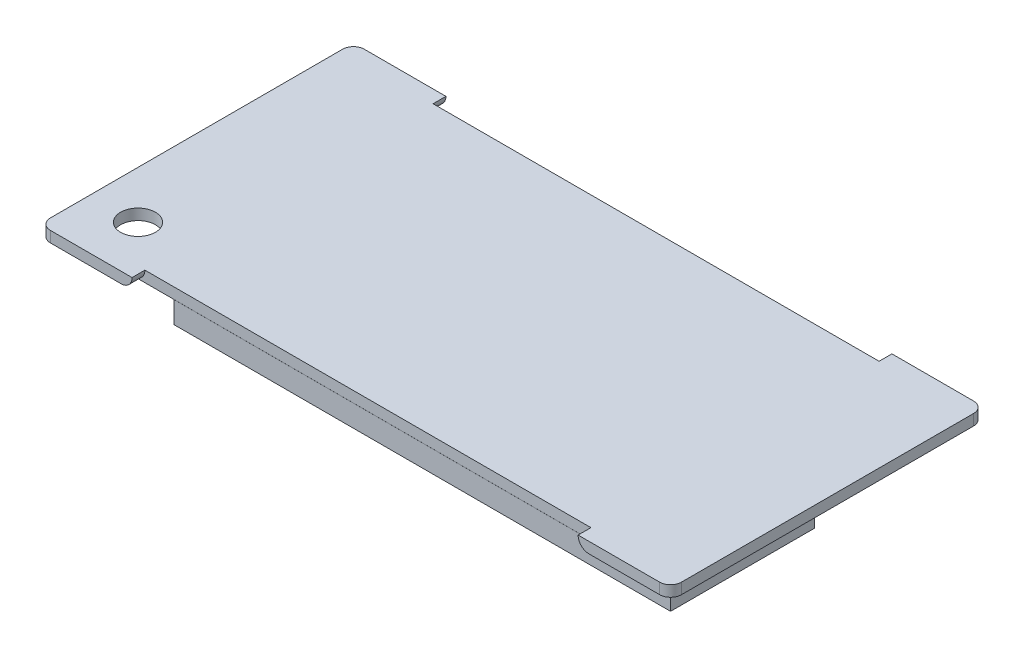
ISO-10303-21;
HEADER;
FILE_DESCRIPTION(('STEP AP214'),'2;1');
FILE_NAME('part.step','',(''),(''),'','','');
FILE_SCHEMA(('AUTOMOTIVE_DESIGN { 1 0 10303 214 1 1 1 1 }'));
ENDSEC;
DATA;
#1=APPLICATION_CONTEXT('core data for automotive mechanical design processes');
#2=APPLICATION_PROTOCOL_DEFINITION('international standard','automotive_design',2000,#1);
#3=PRODUCT_CONTEXT('',#1,'mechanical');
#4=PRODUCT('Part','Part','',(#3));
#5=PRODUCT_RELATED_PRODUCT_CATEGORY('part','',(#4));
#6=PRODUCT_DEFINITION_FORMATION('','',#4);
#7=PRODUCT_DEFINITION_CONTEXT('part definition',#1,'design');
#8=PRODUCT_DEFINITION('design','',#6,#7);
#9=PRODUCT_DEFINITION_SHAPE('','',#8);
#10=(LENGTH_UNIT() NAMED_UNIT(*) SI_UNIT(.MILLI.,.METRE.));
#11=(NAMED_UNIT(*) PLANE_ANGLE_UNIT() SI_UNIT($,.RADIAN.));
#12=(NAMED_UNIT(*) SI_UNIT($,.STERADIAN.) SOLID_ANGLE_UNIT());
#13=UNCERTAINTY_MEASURE_WITH_UNIT(LENGTH_MEASURE(1.E-05),#10,'distance_accuracy_value','');
#14=(GEOMETRIC_REPRESENTATION_CONTEXT(3) GLOBAL_UNCERTAINTY_ASSIGNED_CONTEXT((#13)) GLOBAL_UNIT_ASSIGNED_CONTEXT((#10,
#11,#12)) REPRESENTATION_CONTEXT('',''));
#15=CARTESIAN_POINT('',(0.,0.,0.));
#16=DIRECTION('',(0.,0.,1.));
#17=DIRECTION('',(1.,0.,0.));
#18=AXIS2_PLACEMENT_3D('',#15,#16,#17);
#19=CARTESIAN_POINT('',(28.,0.,-13.425));
#20=DIRECTION('',(0.,-1.,0.));
#21=DIRECTION('',(0.,0.,-1.));
#22=AXIS2_PLACEMENT_3D('',#19,#20,#21);
#23=PLANE('',#22);
#24=CARTESIAN_POINT('',(-24.6274598564771,0.,9.75047176335973));
#25=DIRECTION('',(0.,-1.,0.));
#26=DIRECTION('',(0.,0.,-1.));
#27=AXIS2_PLACEMENT_3D('',#24,#25,#26);
#28=CIRCLE('',#27,1.6);
#29=CARTESIAN_POINT('',(-24.6274598564771,0.,8.15047176335973));
#30=VERTEX_POINT('',#29);
#31=EDGE_CURVE('E765',#30,#30,#28,.T.);
#32=ORIENTED_EDGE('',*,*,#31,.F.);
#33=EDGE_LOOP('',(#32));
#34=FACE_BOUND('',#33,.T.);
#35=DIRECTION('',(-1.,0.,0.));
#36=VECTOR('',#35,1.);
#37=CARTESIAN_POINT('',(-28.,0.,-14.425));
#38=LINE('',#37,#36);
#39=CARTESIAN_POINT('',(-21.5,0.,-14.425));
#40=VERTEX_POINT('',#39);
#41=CARTESIAN_POINT('',(-28.,0.,-14.425));
#42=VERTEX_POINT('',#41);
#43=EDGE_CURVE('E415',#40,#42,#38,.T.);
#44=ORIENTED_EDGE('',*,*,#43,.F.);
#45=DIRECTION('',(0.,0.,-1.));
#46=VECTOR('',#45,1.);
#47=CARTESIAN_POINT('',(-21.5,0.,-13.25));
#48=LINE('',#47,#46);
#49=CARTESIAN_POINT('',(-21.5,0.,-13.25));
#50=VERTEX_POINT('',#49);
#51=EDGE_CURVE('E517',#40,#50,#48,.F.);
#52=ORIENTED_EDGE('',*,*,#51,.T.);
#53=DIRECTION('',(1.,0.,0.));
#54=VECTOR('',#53,1.);
#55=CARTESIAN_POINT('',(-27.825,0.,-13.25));
#56=LINE('',#55,#54);
#57=CARTESIAN_POINT('',(-27.825,0.,-13.25));
#58=VERTEX_POINT('',#57);
#59=EDGE_CURVE('E702',#58,#50,#56,.T.);
#60=ORIENTED_EDGE('',*,*,#59,.F.);
#61=DIRECTION('',(0.,0.,-1.));
#62=VECTOR('',#61,1.);
#63=CARTESIAN_POINT('',(-27.825,0.,3.25));
#64=LINE('',#63,#62);
#65=CARTESIAN_POINT('',(-27.825,0.,3.25));
#66=VERTEX_POINT('',#65);
#67=EDGE_CURVE('E277',#66,#58,#64,.T.);
#68=ORIENTED_EDGE('',*,*,#67,.F.);
#69=DIRECTION('',(-1.,0.,0.));
#70=VECTOR('',#69,1.);
#71=CARTESIAN_POINT('',(-27.825,0.,3.25));
#72=LINE('',#71,#70);
#73=CARTESIAN_POINT('',(-26.825,0.,3.25));
#74=VERTEX_POINT('',#73);
#75=EDGE_CURVE('E273',#74,#66,#72,.T.);
#76=ORIENTED_EDGE('',*,*,#75,.F.);
#77=DIRECTION('',(0.,0.,1.));
#78=VECTOR('',#77,1.);
#79=CARTESIAN_POINT('',(-26.825,0.,-12.25));
#80=LINE('',#79,#78);
#81=CARTESIAN_POINT('',(-26.825,0.,-12.25));
#82=VERTEX_POINT('',#81);
#83=EDGE_CURVE('E724',#82,#74,#80,.T.);
#84=ORIENTED_EDGE('',*,*,#83,.F.);
#85=DIRECTION('',(-1.,0.,0.));
#86=VECTOR('',#85,1.);
#87=CARTESIAN_POINT('',(16.5,0.,-12.25));
#88=LINE('',#87,#86);
#89=CARTESIAN_POINT('',(16.5,0.,-12.25));
#90=VERTEX_POINT('',#89);
#91=EDGE_CURVE('E718',#90,#82,#88,.T.);
#92=ORIENTED_EDGE('',*,*,#91,.F.);
#93=DIRECTION('',(0.,0.,-1.));
#94=VECTOR('',#93,1.);
#95=CARTESIAN_POINT('',(16.5,0.,-13.425));
#96=LINE('',#95,#94);
#97=CARTESIAN_POINT('',(16.5,0.,-13.245));
#98=VERTEX_POINT('',#97);
#99=EDGE_CURVE('E499',#90,#98,#96,.T.);
#100=ORIENTED_EDGE('',*,*,#99,.T.);
#101=DIRECTION('',(-1.,0.,0.));
#102=VECTOR('',#101,1.);
#103=CARTESIAN_POINT('',(-20.5,0.,-13.245));
#104=LINE('',#103,#102);
#105=CARTESIAN_POINT('',(21.5,0.,-13.245));
#106=VERTEX_POINT('',#105);
#107=EDGE_CURVE('E456',#106,#98,#104,.T.);
#108=ORIENTED_EDGE('',*,*,#107,.F.);
#109=DIRECTION('',(0.,0.,1.));
#110=VECTOR('',#109,1.);
#111=CARTESIAN_POINT('',(21.5,0.,-14.425));
#112=LINE('',#111,#110);
#113=CARTESIAN_POINT('',(21.5,0.,-14.425));
#114=VERTEX_POINT('',#113);
#115=EDGE_CURVE('E514',#106,#114,#112,.F.);
#116=ORIENTED_EDGE('',*,*,#115,.T.);
#117=DIRECTION('',(-1.,0.,0.));
#118=VECTOR('',#117,1.);
#119=CARTESIAN_POINT('',(20.5,0.,-14.425));
#120=LINE('',#119,#118);
#121=CARTESIAN_POINT('',(28.,0.,-14.425));
#122=VERTEX_POINT('',#121);
#123=EDGE_CURVE('E451',#122,#114,#120,.T.);
#124=ORIENTED_EDGE('',*,*,#123,.F.);
#125=CARTESIAN_POINT('',(28.,0.,-13.425));
#126=DIRECTION('',(0.,1.,0.));
#127=DIRECTION('',(0.,0.,-1.));
#128=AXIS2_PLACEMENT_3D('',#125,#126,#127);
#129=CIRCLE('',#128,1.);
#130=CARTESIAN_POINT('',(29.,0.,-13.425));
#131=VERTEX_POINT('',#130);
#132=EDGE_CURVE('E448',#131,#122,#129,.T.);
#133=ORIENTED_EDGE('',*,*,#132,.F.);
#134=DIRECTION('',(0.,0.,-1.));
#135=VECTOR('',#134,1.);
#136=CARTESIAN_POINT('',(29.,0.,-13.425));
#137=LINE('',#136,#135);
#138=CARTESIAN_POINT('',(29.,0.,13.425));
#139=VERTEX_POINT('',#138);
#140=EDGE_CURVE('E445',#139,#131,#137,.T.);
#141=ORIENTED_EDGE('',*,*,#140,.F.);
#142=CARTESIAN_POINT('',(28.,0.,13.425));
#143=DIRECTION('',(0.,1.,0.));
#144=DIRECTION('',(0.,0.,1.));
#145=AXIS2_PLACEMENT_3D('',#142,#143,#144);
#146=CIRCLE('',#145,1.);
#147=CARTESIAN_POINT('',(28.,0.,14.425));
#148=VERTEX_POINT('',#147);
#149=EDGE_CURVE('E442',#148,#139,#146,.T.);
#150=ORIENTED_EDGE('',*,*,#149,.F.);
#151=DIRECTION('',(1.,0.,0.));
#152=VECTOR('',#151,1.);
#153=CARTESIAN_POINT('',(20.5,0.,14.425));
#154=LINE('',#153,#152);
#155=CARTESIAN_POINT('',(21.5,0.,14.425));
#156=VERTEX_POINT('',#155);
#157=EDGE_CURVE('E439',#156,#148,#154,.T.);
#158=ORIENTED_EDGE('',*,*,#157,.F.);
#159=DIRECTION('',(0.,0.,1.));
#160=VECTOR('',#159,1.);
#161=CARTESIAN_POINT('',(21.5,0.,13.25));
#162=LINE('',#161,#160);
#163=CARTESIAN_POINT('',(21.5,0.,13.25));
#164=VERTEX_POINT('',#163);
#165=EDGE_CURVE('E511',#156,#164,#162,.F.);
#166=ORIENTED_EDGE('',*,*,#165,.T.);
#167=DIRECTION('',(-1.,0.,0.));
#168=VECTOR('',#167,1.);
#169=CARTESIAN_POINT('',(27.825,0.,13.25));
#170=LINE('',#169,#168);
#171=CARTESIAN_POINT('',(27.825,0.,13.25));
#172=VERTEX_POINT('',#171);
#173=EDGE_CURVE('E312',#172,#164,#170,.T.);
#174=ORIENTED_EDGE('',*,*,#173,.F.);
#175=DIRECTION('',(0.,0.,1.));
#176=VECTOR('',#175,1.);
#177=CARTESIAN_POINT('',(27.825,0.,0.));
#178=LINE('',#177,#176);
#179=CARTESIAN_POINT('',(27.825,0.,0.));
#180=VERTEX_POINT('',#179);
#181=EDGE_CURVE('E280',#180,#172,#178,.T.);
#182=ORIENTED_EDGE('',*,*,#181,.F.);
#183=DIRECTION('',(1.,0.,0.));
#184=VECTOR('',#183,1.);
#185=CARTESIAN_POINT('',(26.825,0.,0.));
#186=LINE('',#185,#184);
#187=CARTESIAN_POINT('',(26.825,0.,0.));
#188=VERTEX_POINT('',#187);
#189=EDGE_CURVE('E296',#188,#180,#186,.T.);
#190=ORIENTED_EDGE('',*,*,#189,.F.);
#191=DIRECTION('',(0.,0.,-1.));
#192=VECTOR('',#191,1.);
#193=CARTESIAN_POINT('',(26.825,0.,12.25));
#194=LINE('',#193,#192);
#195=CARTESIAN_POINT('',(26.825,0.,12.25));
#196=VERTEX_POINT('',#195);
#197=EDGE_CURVE('E325',#196,#188,#194,.T.);
#198=ORIENTED_EDGE('',*,*,#197,.F.);
#199=DIRECTION('',(1.,0.,0.));
#200=VECTOR('',#199,1.);
#201=CARTESIAN_POINT('',(-17.825,0.,12.25));
#202=LINE('',#201,#200);
#203=CARTESIAN_POINT('',(-17.825,0.,12.25));
#204=VERTEX_POINT('',#203);
#205=EDGE_CURVE('E320',#204,#196,#202,.T.);
#206=ORIENTED_EDGE('',*,*,#205,.F.);
#207=DIRECTION('',(0.,0.,-1.));
#208=VECTOR('',#207,1.);
#209=CARTESIAN_POINT('',(-17.825,0.,13.25));
#210=LINE('',#209,#208);
#211=CARTESIAN_POINT('',(-17.825,0.,13.245));
#212=VERTEX_POINT('',#211);
#213=EDGE_CURVE('E321',#212,#204,#210,.T.);
#214=ORIENTED_EDGE('',*,*,#213,.F.);
#215=DIRECTION('',(1.,0.,0.));
#216=VECTOR('',#215,1.);
#217=CARTESIAN_POINT('',(-20.5,0.,13.245));
#218=LINE('',#217,#216);
#219=CARTESIAN_POINT('',(-21.5,0.,13.245));
#220=VERTEX_POINT('',#219);
#221=EDGE_CURVE('E432',#220,#212,#218,.T.);
#222=ORIENTED_EDGE('',*,*,#221,.F.);
#223=DIRECTION('',(0.,0.,-1.));
#224=VECTOR('',#223,1.);
#225=CARTESIAN_POINT('',(-21.5,0.,14.425));
#226=LINE('',#225,#224);
#227=CARTESIAN_POINT('',(-21.5,0.,14.425));
#228=VERTEX_POINT('',#227);
#229=EDGE_CURVE('E508',#220,#228,#226,.F.);
#230=ORIENTED_EDGE('',*,*,#229,.T.);
#231=DIRECTION('',(1.,0.,0.));
#232=VECTOR('',#231,1.);
#233=CARTESIAN_POINT('',(-28.,0.,14.425));
#234=LINE('',#233,#232);
#235=CARTESIAN_POINT('',(-28.,0.,14.425));
#236=VERTEX_POINT('',#235);
#237=EDGE_CURVE('E427',#236,#228,#234,.T.);
#238=ORIENTED_EDGE('',*,*,#237,.F.);
#239=CARTESIAN_POINT('',(-28.,0.,13.425));
#240=DIRECTION('',(0.,1.,0.));
#241=DIRECTION('',(0.,0.,1.));
#242=AXIS2_PLACEMENT_3D('',#239,#240,#241);
#243=CIRCLE('',#242,1.);
#244=CARTESIAN_POINT('',(-29.,0.,13.425));
#245=VERTEX_POINT('',#244);
#246=EDGE_CURVE('E424',#245,#236,#243,.T.);
#247=ORIENTED_EDGE('',*,*,#246,.F.);
#248=DIRECTION('',(0.,0.,1.));
#249=VECTOR('',#248,1.);
#250=CARTESIAN_POINT('',(-29.,0.,-13.425));
#251=LINE('',#250,#249);
#252=CARTESIAN_POINT('',(-29.,0.,-13.425));
#253=VERTEX_POINT('',#252);
#254=EDGE_CURVE('E421',#253,#245,#251,.T.);
#255=ORIENTED_EDGE('',*,*,#254,.F.);
#256=CARTESIAN_POINT('',(-28.,0.,-13.425));
#257=DIRECTION('',(0.,1.,0.));
#258=DIRECTION('',(0.,0.,1.));
#259=AXIS2_PLACEMENT_3D('',#256,#257,#258);
#260=CIRCLE('',#259,1.);
#261=EDGE_CURVE('E418',#42,#253,#260,.T.);
#262=ORIENTED_EDGE('',*,*,#261,.F.);
#263=EDGE_LOOP('',(#44,#52,#60,#68,#76,#84,#92,#100,#108,#116,#124,#133,#141,#150,#158,#166,
#174,#182,#190,#198,#206,#214,#222,#230,#238,#247,#255,#262));
#264=FACE_BOUND('',#263,.T.);
#265=ADVANCED_FACE('F41',(#34,#264),#23,.T.);
#266=CARTESIAN_POINT('',(-20.5,1.,-14.425));
#267=DIRECTION('',(-1.,0.,0.));
#268=DIRECTION('',(0.,0.,1.));
#269=AXIS2_PLACEMENT_3D('',#266,#267,#268);
#270=PLANE('',#269);
#271=DIRECTION('',(0.,0.,-1.));
#272=VECTOR('',#271,1.);
#273=CARTESIAN_POINT('',(-20.5,0.,-14.425));
#274=LINE('',#273,#272);
#275=CARTESIAN_POINT('',(-20.5,0.,-13.245));
#276=VERTEX_POINT('',#275);
#277=CARTESIAN_POINT('',(-20.5,0.,-13.25));
#278=VERTEX_POINT('',#277);
#279=EDGE_CURVE('E355',#276,#278,#274,.T.);
#280=ORIENTED_EDGE('',*,*,#279,.T.);
#281=DIRECTION('',(0.,1.,0.));
#282=VECTOR('',#281,1.);
#283=CARTESIAN_POINT('',(-20.5,1.,-13.25));
#284=LINE('',#283,#282);
#285=CARTESIAN_POINT('',(-20.5,1.,-13.25));
#286=VERTEX_POINT('',#285);
#287=EDGE_CURVE('E66',#278,#286,#284,.T.);
#288=ORIENTED_EDGE('',*,*,#287,.T.);
#289=DIRECTION('',(0.,0.,-1.));
#290=VECTOR('',#289,1.);
#291=CARTESIAN_POINT('',(-20.5,1.,-14.425));
#292=LINE('',#291,#290);
#293=CARTESIAN_POINT('',(-20.5,1.,-13.245));
#294=VERTEX_POINT('',#293);
#295=EDGE_CURVE('E356',#294,#286,#292,.T.);
#296=ORIENTED_EDGE('',*,*,#295,.F.);
#297=DIRECTION('',(0.,-1.,0.));
#298=VECTOR('',#297,1.);
#299=CARTESIAN_POINT('',(-20.5,1.,-13.245));
#300=LINE('',#299,#298);
#301=EDGE_CURVE('E412',#294,#276,#300,.T.);
#302=ORIENTED_EDGE('',*,*,#301,.T.);
#303=EDGE_LOOP('',(#280,#288,#296,#302));
#304=FACE_BOUND('',#303,.T.);
#305=ADVANCED_FACE('F607',(#304),#270,.F.);
#306=CARTESIAN_POINT('',(-28.,1.,-14.425));
#307=DIRECTION('',(0.,0.,1.));
#308=DIRECTION('',(1.,0.,0.));
#309=AXIS2_PLACEMENT_3D('',#306,#307,#308);
#310=PLANE('',#309);
#311=DIRECTION('',(-1.,0.,0.));
#312=VECTOR('',#311,1.);
#313=CARTESIAN_POINT('',(-28.,1.,-14.425));
#314=LINE('',#313,#312);
#315=CARTESIAN_POINT('',(-20.5,1.,-14.425));
#316=VERTEX_POINT('',#315);
#317=CARTESIAN_POINT('',(-28.,1.,-14.425));
#318=VERTEX_POINT('',#317);
#319=EDGE_CURVE('E360',#316,#318,#314,.T.);
#320=ORIENTED_EDGE('',*,*,#319,.F.);
#321=CARTESIAN_POINT('',(-21.5,1.,-14.425));
#322=DIRECTION('',(0.,0.,1.));
#323=DIRECTION('',(1.,0.,0.));
#324=AXIS2_PLACEMENT_3D('',#321,#322,#323);
#325=CIRCLE('',#324,1.);
#326=EDGE_CURVE('E505',#316,#40,#325,.F.);
#327=ORIENTED_EDGE('',*,*,#326,.T.);
#328=ORIENTED_EDGE('',*,*,#43,.T.);
#329=DIRECTION('',(0.,-1.,0.));
#330=VECTOR('',#329,1.);
#331=CARTESIAN_POINT('',(-28.,1.,-14.425));
#332=LINE('',#331,#330);
#333=EDGE_CURVE('E495',#318,#42,#332,.T.);
#334=ORIENTED_EDGE('',*,*,#333,.F.);
#335=EDGE_LOOP('',(#320,#327,#328,#334));
#336=FACE_BOUND('',#335,.T.);
#337=ADVANCED_FACE('F613',(#336),#310,.F.);
#338=CARTESIAN_POINT('',(-28.,1.,-13.425));
#339=DIRECTION('',(0.,-1.,0.));
#340=DIRECTION('',(0.,0.,-1.));
#341=AXIS2_PLACEMENT_3D('',#338,#339,#340);
#342=CYLINDRICAL_SURFACE('',#341,1.);
#343=ORIENTED_EDGE('',*,*,#261,.T.);
#344=DIRECTION('',(0.,-1.,0.));
#345=VECTOR('',#344,1.);
#346=CARTESIAN_POINT('',(-29.,1.,-13.425));
#347=LINE('',#346,#345);
#348=CARTESIAN_POINT('',(-29.,1.,-13.425));
#349=VERTEX_POINT('',#348);
#350=EDGE_CURVE('E491',#349,#253,#347,.T.);
#351=ORIENTED_EDGE('',*,*,#350,.F.);
#352=CARTESIAN_POINT('',(-28.,1.,-13.425));
#353=DIRECTION('',(0.,1.,0.));
#354=DIRECTION('',(0.,0.,1.));
#355=AXIS2_PLACEMENT_3D('',#352,#353,#354);
#356=CIRCLE('',#355,1.);
#357=EDGE_CURVE('E364',#318,#349,#356,.T.);
#358=ORIENTED_EDGE('',*,*,#357,.F.);
#359=ORIENTED_EDGE('',*,*,#333,.T.);
#360=EDGE_LOOP('',(#343,#351,#358,#359));
#361=FACE_BOUND('',#360,.T.);
#362=ADVANCED_FACE('F659',(#361),#342,.T.);
#363=CARTESIAN_POINT('',(-29.,1.,-13.425));
#364=DIRECTION('',(1.,0.,0.));
#365=DIRECTION('',(0.,0.,-1.));
#366=AXIS2_PLACEMENT_3D('',#363,#364,#365);
#367=PLANE('',#366);
#368=ORIENTED_EDGE('',*,*,#254,.T.);
#369=DIRECTION('',(0.,-1.,0.));
#370=VECTOR('',#369,1.);
#371=CARTESIAN_POINT('',(-29.,1.,13.425));
#372=LINE('',#371,#370);
#373=CARTESIAN_POINT('',(-29.,1.,13.425));
#374=VERTEX_POINT('',#373);
#375=EDGE_CURVE('E487',#374,#245,#372,.T.);
#376=ORIENTED_EDGE('',*,*,#375,.F.);
#377=DIRECTION('',(0.,0.,1.));
#378=VECTOR('',#377,1.);
#379=CARTESIAN_POINT('',(-29.,1.,-13.425));
#380=LINE('',#379,#378);
#381=EDGE_CURVE('E367',#349,#374,#380,.T.);
#382=ORIENTED_EDGE('',*,*,#381,.F.);
#383=ORIENTED_EDGE('',*,*,#350,.T.);
#384=EDGE_LOOP('',(#368,#376,#382,#383));
#385=FACE_BOUND('',#384,.T.);
#386=ADVANCED_FACE('F655',(#385),#367,.F.);
#387=CARTESIAN_POINT('',(-28.,1.,13.425));
#388=DIRECTION('',(0.,-1.,0.));
#389=DIRECTION('',(0.,0.,-1.));
#390=AXIS2_PLACEMENT_3D('',#387,#388,#389);
#391=CYLINDRICAL_SURFACE('',#390,1.);
#392=ORIENTED_EDGE('',*,*,#246,.T.);
#393=DIRECTION('',(0.,-1.,0.));
#394=VECTOR('',#393,1.);
#395=CARTESIAN_POINT('',(-28.,1.,14.425));
#396=LINE('',#395,#394);
#397=CARTESIAN_POINT('',(-28.,1.,14.425));
#398=VERTEX_POINT('',#397);
#399=EDGE_CURVE('E483',#398,#236,#396,.T.);
#400=ORIENTED_EDGE('',*,*,#399,.F.);
#401=CARTESIAN_POINT('',(-28.,1.,13.425));
#402=DIRECTION('',(0.,1.,0.));
#403=DIRECTION('',(0.,0.,1.));
#404=AXIS2_PLACEMENT_3D('',#401,#402,#403);
#405=CIRCLE('',#404,1.);
#406=EDGE_CURVE('E370',#374,#398,#405,.T.);
#407=ORIENTED_EDGE('',*,*,#406,.F.);
#408=ORIENTED_EDGE('',*,*,#375,.T.);
#409=EDGE_LOOP('',(#392,#400,#407,#408));
#410=FACE_BOUND('',#409,.T.);
#411=ADVANCED_FACE('F651',(#410),#391,.T.);
#412=CARTESIAN_POINT('',(-28.,1.,14.425));
#413=DIRECTION('',(0.,0.,-1.));
#414=DIRECTION('',(-1.,0.,0.));
#415=AXIS2_PLACEMENT_3D('',#412,#413,#414);
#416=PLANE('',#415);
#417=ORIENTED_EDGE('',*,*,#237,.T.);
#418=CARTESIAN_POINT('',(-21.5,1.,14.425));
#419=DIRECTION('',(0.,0.,-1.));
#420=DIRECTION('',(-1.,0.,0.));
#421=AXIS2_PLACEMENT_3D('',#418,#419,#420);
#422=CIRCLE('',#421,1.);
#423=CARTESIAN_POINT('',(-20.5,1.,14.425));
#424=VERTEX_POINT('',#423);
#425=EDGE_CURVE('E528',#228,#424,#422,.F.);
#426=ORIENTED_EDGE('',*,*,#425,.T.);
#427=DIRECTION('',(1.,0.,0.));
#428=VECTOR('',#427,1.);
#429=CARTESIAN_POINT('',(-28.,1.,14.425));
#430=LINE('',#429,#428);
#431=EDGE_CURVE('E373',#398,#424,#430,.T.);
#432=ORIENTED_EDGE('',*,*,#431,.F.);
#433=ORIENTED_EDGE('',*,*,#399,.T.);
#434=EDGE_LOOP('',(#417,#426,#432,#433));
#435=FACE_BOUND('',#434,.T.);
#436=ADVANCED_FACE('F648',(#435),#416,.F.);
#437=CARTESIAN_POINT('',(-20.5,1.,13.245));
#438=DIRECTION('',(0.,0.,-1.));
#439=DIRECTION('',(-1.,0.,0.));
#440=AXIS2_PLACEMENT_3D('',#437,#438,#439);
#441=PLANE('',#440);
#442=ORIENTED_EDGE('',*,*,#221,.T.);
#443=CARTESIAN_POINT('',(20.5,0.,13.245));
#444=VERTEX_POINT('',#443);
#445=EDGE_CURVE('E431',#212,#444,#218,.T.);
#446=ORIENTED_EDGE('',*,*,#445,.T.);
#447=DIRECTION('',(0.,-1.,0.));
#448=VECTOR('',#447,1.);
#449=CARTESIAN_POINT('',(20.5,1.,13.245));
#450=LINE('',#449,#448);
#451=CARTESIAN_POINT('',(20.5,1.,13.245));
#452=VERTEX_POINT('',#451);
#453=EDGE_CURVE('E479',#452,#444,#450,.T.);
#454=ORIENTED_EDGE('',*,*,#453,.F.);
#455=DIRECTION('',(1.,0.,0.));
#456=VECTOR('',#455,1.);
#457=CARTESIAN_POINT('',(-20.5,1.,13.245));
#458=LINE('',#457,#456);
#459=CARTESIAN_POINT('',(-20.5,1.,13.245));
#460=VERTEX_POINT('',#459);
#461=EDGE_CURVE('E381',#460,#452,#458,.T.);
#462=ORIENTED_EDGE('',*,*,#461,.F.);
#463=CARTESIAN_POINT('',(-21.5,1.,13.245));
#464=DIRECTION('',(0.,0.,-1.));
#465=DIRECTION('',(-1.,0.,0.));
#466=AXIS2_PLACEMENT_3D('',#463,#464,#465);
#467=CIRCLE('',#466,1.);
#468=EDGE_CURVE('E11',#460,#220,#467,.T.);
#469=ORIENTED_EDGE('',*,*,#468,.T.);
#470=EDGE_LOOP('',(#442,#446,#454,#462,#469));
#471=FACE_BOUND('',#470,.T.);
#472=ADVANCED_FACE('F574',(#471),#441,.F.);
#473=CARTESIAN_POINT('',(20.5,1.,14.425));
#474=DIRECTION('',(1.,0.,0.));
#475=DIRECTION('',(0.,0.,-1.));
#476=AXIS2_PLACEMENT_3D('',#473,#474,#475);
#477=PLANE('',#476);
#478=DIRECTION('',(0.,0.,1.));
#479=VECTOR('',#478,1.);
#480=CARTESIAN_POINT('',(20.5,0.,14.425));
#481=LINE('',#480,#479);
#482=CARTESIAN_POINT('',(20.5,0.,13.25));
#483=VERTEX_POINT('',#482);
#484=EDGE_CURVE('E436',#444,#483,#481,.T.);
#485=ORIENTED_EDGE('',*,*,#484,.T.);
#486=DIRECTION('',(0.,1.,0.));
#487=VECTOR('',#486,1.);
#488=CARTESIAN_POINT('',(20.5,1.,13.25));
#489=LINE('',#488,#487);
#490=CARTESIAN_POINT('',(20.5,1.,13.25));
#491=VERTEX_POINT('',#490);
#492=EDGE_CURVE('E58',#483,#491,#489,.T.);
#493=ORIENTED_EDGE('',*,*,#492,.T.);
#494=DIRECTION('',(0.,0.,1.));
#495=VECTOR('',#494,1.);
#496=CARTESIAN_POINT('',(20.5,1.,14.425));
#497=LINE('',#496,#495);
#498=EDGE_CURVE('E385',#452,#491,#497,.T.);
#499=ORIENTED_EDGE('',*,*,#498,.F.);
#500=ORIENTED_EDGE('',*,*,#453,.T.);
#501=EDGE_LOOP('',(#485,#493,#499,#500));
#502=FACE_BOUND('',#501,.T.);
#503=ADVANCED_FACE('F546',(#502),#477,.F.);
#504=CARTESIAN_POINT('',(20.5,1.,14.425));
#505=DIRECTION('',(0.,0.,-1.));
#506=DIRECTION('',(-1.,0.,0.));
#507=AXIS2_PLACEMENT_3D('',#504,#505,#506);
#508=PLANE('',#507);
#509=DIRECTION('',(1.,0.,0.));
#510=VECTOR('',#509,1.);
#511=CARTESIAN_POINT('',(20.5,1.,14.425));
#512=LINE('',#511,#510);
#513=CARTESIAN_POINT('',(20.5,1.,14.425));
#514=VERTEX_POINT('',#513);
#515=CARTESIAN_POINT('',(28.,1.,14.425));
#516=VERTEX_POINT('',#515);
#517=EDGE_CURVE('E389',#514,#516,#512,.T.);
#518=ORIENTED_EDGE('',*,*,#517,.F.);
#519=CARTESIAN_POINT('',(21.5,1.,14.425));
#520=DIRECTION('',(0.,0.,-1.));
#521=DIRECTION('',(-1.,0.,0.));
#522=AXIS2_PLACEMENT_3D('',#519,#520,#521);
#523=CIRCLE('',#522,1.);
#524=EDGE_CURVE('E525',#514,#156,#523,.F.);
#525=ORIENTED_EDGE('',*,*,#524,.T.);
#526=ORIENTED_EDGE('',*,*,#157,.T.);
#527=DIRECTION('',(0.,-1.,0.));
#528=VECTOR('',#527,1.);
#529=CARTESIAN_POINT('',(28.,1.,14.425));
#530=LINE('',#529,#528);
#531=EDGE_CURVE('E475',#516,#148,#530,.T.);
#532=ORIENTED_EDGE('',*,*,#531,.F.);
#533=EDGE_LOOP('',(#518,#525,#526,#532));
#534=FACE_BOUND('',#533,.T.);
#535=ADVANCED_FACE('F639',(#534),#508,.F.);
#536=CARTESIAN_POINT('',(28.,1.,13.425));
#537=DIRECTION('',(0.,-1.,0.));
#538=DIRECTION('',(0.,0.,-1.));
#539=AXIS2_PLACEMENT_3D('',#536,#537,#538);
#540=CYLINDRICAL_SURFACE('',#539,1.);
#541=ORIENTED_EDGE('',*,*,#149,.T.);
#542=DIRECTION('',(0.,-1.,0.));
#543=VECTOR('',#542,1.);
#544=CARTESIAN_POINT('',(29.,1.,13.425));
#545=LINE('',#544,#543);
#546=CARTESIAN_POINT('',(29.,1.,13.425));
#547=VERTEX_POINT('',#546);
#548=EDGE_CURVE('E471',#547,#139,#545,.T.);
#549=ORIENTED_EDGE('',*,*,#548,.F.);
#550=CARTESIAN_POINT('',(28.,1.,13.425));
#551=DIRECTION('',(0.,1.,0.));
#552=DIRECTION('',(0.,0.,1.));
#553=AXIS2_PLACEMENT_3D('',#550,#551,#552);
#554=CIRCLE('',#553,1.);
#555=EDGE_CURVE('E392',#516,#547,#554,.T.);
#556=ORIENTED_EDGE('',*,*,#555,.F.);
#557=ORIENTED_EDGE('',*,*,#531,.T.);
#558=EDGE_LOOP('',(#541,#549,#556,#557));
#559=FACE_BOUND('',#558,.T.);
#560=ADVANCED_FACE('F635',(#559),#540,.T.);
#561=CARTESIAN_POINT('',(29.,1.,-13.425));
#562=DIRECTION('',(-1.,0.,0.));
#563=DIRECTION('',(0.,0.,1.));
#564=AXIS2_PLACEMENT_3D('',#561,#562,#563);
#565=PLANE('',#564);
#566=ORIENTED_EDGE('',*,*,#140,.T.);
#567=DIRECTION('',(0.,-1.,0.));
#568=VECTOR('',#567,1.);
#569=CARTESIAN_POINT('',(29.,1.,-13.425));
#570=LINE('',#569,#568);
#571=CARTESIAN_POINT('',(29.,1.,-13.425));
#572=VERTEX_POINT('',#571);
#573=EDGE_CURVE('E467',#572,#131,#570,.T.);
#574=ORIENTED_EDGE('',*,*,#573,.F.);
#575=DIRECTION('',(0.,0.,-1.));
#576=VECTOR('',#575,1.);
#577=CARTESIAN_POINT('',(29.,1.,-13.425));
#578=LINE('',#577,#576);
#579=EDGE_CURVE('E395',#547,#572,#578,.T.);
#580=ORIENTED_EDGE('',*,*,#579,.F.);
#581=ORIENTED_EDGE('',*,*,#548,.T.);
#582=EDGE_LOOP('',(#566,#574,#580,#581));
#583=FACE_BOUND('',#582,.T.);
#584=ADVANCED_FACE('F631',(#583),#565,.F.);
#585=CARTESIAN_POINT('',(28.,1.,-13.425));
#586=DIRECTION('',(0.,-1.,0.));
#587=DIRECTION('',(0.,0.,-1.));
#588=AXIS2_PLACEMENT_3D('',#585,#586,#587);
#589=CYLINDRICAL_SURFACE('',#588,1.);
#590=ORIENTED_EDGE('',*,*,#132,.T.);
#591=DIRECTION('',(0.,-1.,0.));
#592=VECTOR('',#591,1.);
#593=CARTESIAN_POINT('',(28.,1.,-14.425));
#594=LINE('',#593,#592);
#595=CARTESIAN_POINT('',(28.,1.,-14.425));
#596=VERTEX_POINT('',#595);
#597=EDGE_CURVE('E463',#596,#122,#594,.T.);
#598=ORIENTED_EDGE('',*,*,#597,.F.);
#599=CARTESIAN_POINT('',(28.,1.,-13.425));
#600=DIRECTION('',(0.,1.,0.));
#601=DIRECTION('',(0.,0.,-1.));
#602=AXIS2_PLACEMENT_3D('',#599,#600,#601);
#603=CIRCLE('',#602,1.);
#604=EDGE_CURVE('E398',#572,#596,#603,.T.);
#605=ORIENTED_EDGE('',*,*,#604,.F.);
#606=ORIENTED_EDGE('',*,*,#573,.T.);
#607=EDGE_LOOP('',(#590,#598,#605,#606));
#608=FACE_BOUND('',#607,.T.);
#609=ADVANCED_FACE('F627',(#608),#589,.T.);
#610=CARTESIAN_POINT('',(20.5,1.,-14.425));
#611=DIRECTION('',(0.,0.,1.));
#612=DIRECTION('',(1.,0.,0.));
#613=AXIS2_PLACEMENT_3D('',#610,#611,#612);
#614=PLANE('',#613);
#615=ORIENTED_EDGE('',*,*,#123,.T.);
#616=CARTESIAN_POINT('',(21.5,1.,-14.425));
#617=DIRECTION('',(0.,0.,1.));
#618=DIRECTION('',(1.,0.,0.));
#619=AXIS2_PLACEMENT_3D('',#616,#617,#618);
#620=CIRCLE('',#619,1.);
#621=CARTESIAN_POINT('',(20.5,1.,-14.425));
#622=VERTEX_POINT('',#621);
#623=EDGE_CURVE('E520',#114,#622,#620,.F.);
#624=ORIENTED_EDGE('',*,*,#623,.T.);
#625=DIRECTION('',(-1.,0.,0.));
#626=VECTOR('',#625,1.);
#627=CARTESIAN_POINT('',(20.5,1.,-14.425));
#628=LINE('',#627,#626);
#629=EDGE_CURVE('E401',#596,#622,#628,.T.);
#630=ORIENTED_EDGE('',*,*,#629,.F.);
#631=ORIENTED_EDGE('',*,*,#597,.T.);
#632=EDGE_LOOP('',(#615,#624,#630,#631));
#633=FACE_BOUND('',#632,.T.);
#634=ADVANCED_FACE('F623',(#633),#614,.F.);
#635=CARTESIAN_POINT('',(-20.5,1.,-13.245));
#636=DIRECTION('',(0.,0.,1.));
#637=DIRECTION('',(1.,0.,0.));
#638=AXIS2_PLACEMENT_3D('',#635,#636,#637);
#639=PLANE('',#638);
#640=ORIENTED_EDGE('',*,*,#107,.T.);
#641=EDGE_CURVE('E455',#98,#276,#104,.T.);
#642=ORIENTED_EDGE('',*,*,#641,.T.);
#643=ORIENTED_EDGE('',*,*,#301,.F.);
#644=DIRECTION('',(-1.,0.,0.));
#645=VECTOR('',#644,1.);
#646=CARTESIAN_POINT('',(-20.5,1.,-13.245));
#647=LINE('',#646,#645);
#648=CARTESIAN_POINT('',(20.5,1.,-13.245));
#649=VERTEX_POINT('',#648);
#650=EDGE_CURVE('E409',#649,#294,#647,.T.);
#651=ORIENTED_EDGE('',*,*,#650,.F.);
#652=CARTESIAN_POINT('',(21.5,1.,-13.245));
#653=DIRECTION('',(0.,0.,1.));
#654=DIRECTION('',(1.,0.,0.));
#655=AXIS2_PLACEMENT_3D('',#652,#653,#654);
#656=CIRCLE('',#655,1.);
#657=EDGE_CURVE('E534',#649,#106,#656,.T.);
#658=ORIENTED_EDGE('',*,*,#657,.T.);
#659=EDGE_LOOP('',(#640,#642,#643,#651,#658));
#660=FACE_BOUND('',#659,.T.);
#661=ADVANCED_FACE('F620',(#660),#639,.F.);
#662=CARTESIAN_POINT('',(28.,1.,-13.425));
#663=DIRECTION('',(0.,-1.,0.));
#664=DIRECTION('',(0.,0.,-1.));
#665=AXIS2_PLACEMENT_3D('',#662,#663,#664);
#666=PLANE('',#665);
#667=CARTESIAN_POINT('',(-24.6274598564771,0.999999999999999,9.75047176335973));
#668=DIRECTION('',(0.,-1.,0.));
#669=DIRECTION('',(0.,0.,-1.));
#670=AXIS2_PLACEMENT_3D('',#667,#668,#669);
#671=CIRCLE('',#670,1.6);
#672=CARTESIAN_POINT('',(-24.6274598564771,0.999999999999999,8.15047176335973));
#673=VERTEX_POINT('',#672);
#674=EDGE_CURVE('E45',#673,#673,#671,.T.);
#675=ORIENTED_EDGE('',*,*,#674,.T.);
#676=EDGE_LOOP('',(#675));
#677=FACE_BOUND('',#676,.T.);
#678=ORIENTED_EDGE('',*,*,#295,.T.);
#679=EDGE_CURVE('E361',#286,#316,#292,.T.);
#680=ORIENTED_EDGE('',*,*,#679,.T.);
#681=ORIENTED_EDGE('',*,*,#319,.T.);
#682=ORIENTED_EDGE('',*,*,#357,.T.);
#683=ORIENTED_EDGE('',*,*,#381,.T.);
#684=ORIENTED_EDGE('',*,*,#406,.T.);
#685=ORIENTED_EDGE('',*,*,#431,.T.);
#686=DIRECTION('',(0.,0.,-1.));
#687=VECTOR('',#686,1.);
#688=CARTESIAN_POINT('',(-20.5,1.,14.425));
#689=LINE('',#688,#687);
#690=EDGE_CURVE('E377',#424,#460,#689,.T.);
#691=ORIENTED_EDGE('',*,*,#690,.T.);
#692=ORIENTED_EDGE('',*,*,#461,.T.);
#693=ORIENTED_EDGE('',*,*,#498,.T.);
#694=EDGE_CURVE('E384',#491,#514,#497,.T.);
#695=ORIENTED_EDGE('',*,*,#694,.T.);
#696=ORIENTED_EDGE('',*,*,#517,.T.);
#697=ORIENTED_EDGE('',*,*,#555,.T.);
#698=ORIENTED_EDGE('',*,*,#579,.T.);
#699=ORIENTED_EDGE('',*,*,#604,.T.);
#700=ORIENTED_EDGE('',*,*,#629,.T.);
#701=DIRECTION('',(0.,0.,1.));
#702=VECTOR('',#701,1.);
#703=CARTESIAN_POINT('',(20.5,1.,-14.425));
#704=LINE('',#703,#702);
#705=EDGE_CURVE('E405',#622,#649,#704,.T.);
#706=ORIENTED_EDGE('',*,*,#705,.T.);
#707=ORIENTED_EDGE('',*,*,#650,.T.);
#708=EDGE_LOOP('',(#678,#680,#681,#682,#683,#684,#685,#691,#692,#693,#695,#696,#697,#698,#699,
#700,#706,#707));
#709=FACE_BOUND('',#708,.T.);
#710=ADVANCED_FACE('F551',(#677,#709),#666,.F.);
#711=CARTESIAN_POINT('',(27.825,-2.,0.));
#712=DIRECTION('',(-1.,0.,0.));
#713=DIRECTION('',(0.,0.,1.));
#714=AXIS2_PLACEMENT_3D('',#711,#712,#713);
#715=PLANE('',#714);
#716=ORIENTED_EDGE('',*,*,#181,.T.);
#717=DIRECTION('',(0.,1.,0.));
#718=VECTOR('',#717,1.);
#719=CARTESIAN_POINT('',(27.825,-2.,13.25));
#720=LINE('',#719,#718);
#721=CARTESIAN_POINT('',(27.825,-2.,13.25));
#722=VERTEX_POINT('',#721);
#723=EDGE_CURVE('E351',#722,#172,#720,.T.);
#724=ORIENTED_EDGE('',*,*,#723,.F.);
#725=DIRECTION('',(0.,0.,1.));
#726=VECTOR('',#725,1.);
#727=CARTESIAN_POINT('',(27.825,-2.,0.));
#728=LINE('',#727,#726);
#729=CARTESIAN_POINT('',(27.825,-2.,0.));
#730=VERTEX_POINT('',#729);
#731=EDGE_CURVE('E291',#730,#722,#728,.T.);
#732=ORIENTED_EDGE('',*,*,#731,.F.);
#733=DIRECTION('',(0.,1.,0.));
#734=VECTOR('',#733,1.);
#735=CARTESIAN_POINT('',(27.825,-2.,0.));
#736=LINE('',#735,#734);
#737=EDGE_CURVE('E310',#730,#180,#736,.T.);
#738=ORIENTED_EDGE('',*,*,#737,.T.);
#739=EDGE_LOOP('',(#716,#724,#732,#738));
#740=FACE_BOUND('',#739,.T.);
#741=ADVANCED_FACE('F591',(#740),#715,.F.);
#742=CARTESIAN_POINT('',(27.825,-2.,13.25));
#743=DIRECTION('',(0.,0.,-1.));
#744=DIRECTION('',(-1.,0.,0.));
#745=AXIS2_PLACEMENT_3D('',#742,#743,#744);
#746=PLANE('',#745);
#747=ORIENTED_EDGE('',*,*,#173,.T.);
#748=CARTESIAN_POINT('',(21.5,1.,13.25));
#749=DIRECTION('',(0.,0.,-1.));
#750=DIRECTION('',(-1.,0.,0.));
#751=AXIS2_PLACEMENT_3D('',#748,#749,#750);
#752=CIRCLE('',#751,1.);
#753=EDGE_CURVE('E51',#164,#491,#752,.T.);
#754=ORIENTED_EDGE('',*,*,#753,.T.);
#755=ORIENTED_EDGE('',*,*,#492,.F.);
#756=CARTESIAN_POINT('',(-17.825,0.,13.25));
#757=VERTEX_POINT('',#756);
#758=EDGE_CURVE('E285',#483,#757,#170,.T.);
#759=ORIENTED_EDGE('',*,*,#758,.T.);
#760=DIRECTION('',(0.,1.,0.));
#761=VECTOR('',#760,1.);
#762=CARTESIAN_POINT('',(-17.825,-2.,13.25));
#763=LINE('',#762,#761);
#764=CARTESIAN_POINT('',(-17.825,-2.,13.25));
#765=VERTEX_POINT('',#764);
#766=EDGE_CURVE('E347',#765,#757,#763,.T.);
#767=ORIENTED_EDGE('',*,*,#766,.F.);
#768=DIRECTION('',(-1.,0.,0.));
#769=VECTOR('',#768,1.);
#770=CARTESIAN_POINT('',(27.825,-2.,13.25));
#771=LINE('',#770,#769);
#772=EDGE_CURVE('E295',#722,#765,#771,.T.);
#773=ORIENTED_EDGE('',*,*,#772,.F.);
#774=ORIENTED_EDGE('',*,*,#723,.T.);
#775=EDGE_LOOP('',(#747,#754,#755,#759,#767,#773,#774));
#776=FACE_BOUND('',#775,.T.);
#777=ADVANCED_FACE('F540',(#776),#746,.F.);
#778=CARTESIAN_POINT('',(-17.825,-2.,13.25));
#779=DIRECTION('',(1.,0.,0.));
#780=DIRECTION('',(0.,0.,-1.));
#781=AXIS2_PLACEMENT_3D('',#778,#779,#780);
#782=PLANE('',#781);
#783=EDGE_CURVE('E316',#757,#212,#210,.T.);
#784=ORIENTED_EDGE('',*,*,#783,.T.);
#785=ORIENTED_EDGE('',*,*,#213,.T.);
#786=DIRECTION('',(0.,1.,0.));
#787=VECTOR('',#786,1.);
#788=CARTESIAN_POINT('',(-17.825,-2.,12.25));
#789=LINE('',#788,#787);
#790=CARTESIAN_POINT('',(-17.825,-2.,12.25));
#791=VERTEX_POINT('',#790);
#792=EDGE_CURVE('E343',#791,#204,#789,.T.);
#793=ORIENTED_EDGE('',*,*,#792,.F.);
#794=DIRECTION('',(0.,0.,-1.));
#795=VECTOR('',#794,1.);
#796=CARTESIAN_POINT('',(-17.825,-2.,13.25));
#797=LINE('',#796,#795);
#798=EDGE_CURVE('E299',#765,#791,#797,.T.);
#799=ORIENTED_EDGE('',*,*,#798,.F.);
#800=ORIENTED_EDGE('',*,*,#766,.T.);
#801=EDGE_LOOP('',(#784,#785,#793,#799,#800));
#802=FACE_BOUND('',#801,.T.);
#803=ADVANCED_FACE('F568',(#802),#782,.F.);
#804=CARTESIAN_POINT('',(-17.825,-2.,12.25));
#805=DIRECTION('',(0.,0.,1.));
#806=DIRECTION('',(1.,0.,0.));
#807=AXIS2_PLACEMENT_3D('',#804,#805,#806);
#808=PLANE('',#807);
#809=ORIENTED_EDGE('',*,*,#205,.T.);
#810=DIRECTION('',(0.,1.,0.));
#811=VECTOR('',#810,1.);
#812=CARTESIAN_POINT('',(26.825,-2.,12.25));
#813=LINE('',#812,#811);
#814=CARTESIAN_POINT('',(26.825,-2.,12.25));
#815=VERTEX_POINT('',#814);
#816=EDGE_CURVE('E339',#815,#196,#813,.T.);
#817=ORIENTED_EDGE('',*,*,#816,.F.);
#818=DIRECTION('',(1.,0.,0.));
#819=VECTOR('',#818,1.);
#820=CARTESIAN_POINT('',(-17.825,-2.,12.25));
#821=LINE('',#820,#819);
#822=EDGE_CURVE('E302',#791,#815,#821,.T.);
#823=ORIENTED_EDGE('',*,*,#822,.F.);
#824=ORIENTED_EDGE('',*,*,#792,.T.);
#825=EDGE_LOOP('',(#809,#817,#823,#824));
#826=FACE_BOUND('',#825,.T.);
#827=ADVANCED_FACE('F582',(#826),#808,.F.);
#828=CARTESIAN_POINT('',(26.825,-2.,12.25));
#829=DIRECTION('',(1.,0.,0.));
#830=DIRECTION('',(0.,0.,-1.));
#831=AXIS2_PLACEMENT_3D('',#828,#829,#830);
#832=PLANE('',#831);
#833=ORIENTED_EDGE('',*,*,#197,.T.);
#834=DIRECTION('',(0.,1.,0.));
#835=VECTOR('',#834,1.);
#836=CARTESIAN_POINT('',(26.825,-2.,0.));
#837=LINE('',#836,#835);
#838=CARTESIAN_POINT('',(26.825,-2.,0.));
#839=VERTEX_POINT('',#838);
#840=EDGE_CURVE('E335',#839,#188,#837,.T.);
#841=ORIENTED_EDGE('',*,*,#840,.F.);
#842=DIRECTION('',(0.,0.,-1.));
#843=VECTOR('',#842,1.);
#844=CARTESIAN_POINT('',(26.825,-2.,12.25));
#845=LINE('',#844,#843);
#846=EDGE_CURVE('E305',#815,#839,#845,.T.);
#847=ORIENTED_EDGE('',*,*,#846,.F.);
#848=ORIENTED_EDGE('',*,*,#816,.T.);
#849=EDGE_LOOP('',(#833,#841,#847,#848));
#850=FACE_BOUND('',#849,.T.);
#851=ADVANCED_FACE('F597',(#850),#832,.F.);
#852=CARTESIAN_POINT('',(26.825,-2.,0.));
#853=DIRECTION('',(0.,0.,1.));
#854=DIRECTION('',(1.,0.,0.));
#855=AXIS2_PLACEMENT_3D('',#852,#853,#854);
#856=PLANE('',#855);
#857=ORIENTED_EDGE('',*,*,#189,.T.);
#858=ORIENTED_EDGE('',*,*,#737,.F.);
#859=DIRECTION('',(1.,0.,0.));
#860=VECTOR('',#859,1.);
#861=CARTESIAN_POINT('',(26.825,-2.,0.));
#862=LINE('',#861,#860);
#863=EDGE_CURVE('E308',#839,#730,#862,.T.);
#864=ORIENTED_EDGE('',*,*,#863,.F.);
#865=ORIENTED_EDGE('',*,*,#840,.T.);
#866=EDGE_LOOP('',(#857,#858,#864,#865));
#867=FACE_BOUND('',#866,.T.);
#868=ADVANCED_FACE('F594',(#867),#856,.F.);
#869=CARTESIAN_POINT('',(0.,-2.,0.));
#870=DIRECTION('',(0.,-1.,0.));
#871=DIRECTION('',(0.,0.,-1.));
#872=AXIS2_PLACEMENT_3D('',#869,#870,#871);
#873=PLANE('',#872);
#874=ORIENTED_EDGE('',*,*,#731,.T.);
#875=ORIENTED_EDGE('',*,*,#772,.T.);
#876=ORIENTED_EDGE('',*,*,#798,.T.);
#877=ORIENTED_EDGE('',*,*,#822,.T.);
#878=ORIENTED_EDGE('',*,*,#846,.T.);
#879=ORIENTED_EDGE('',*,*,#863,.T.);
#880=EDGE_LOOP('',(#874,#875,#876,#877,#878,#879));
#881=FACE_BOUND('',#880,.T.);
#882=ADVANCED_FACE('F586',(#881),#873,.T.);
#883=CARTESIAN_POINT('',(0.,0.,0.));
#884=DIRECTION('',(0.,-1.,0.));
#885=DIRECTION('',(0.,0.,-1.));
#886=AXIS2_PLACEMENT_3D('',#883,#884,#885);
#887=PLANE('',#886);
#888=ORIENTED_EDGE('',*,*,#484,.F.);
#889=ORIENTED_EDGE('',*,*,#445,.F.);
#890=ORIENTED_EDGE('',*,*,#783,.F.);
#891=ORIENTED_EDGE('',*,*,#758,.F.);
#892=EDGE_LOOP('',(#888,#889,#890,#891));
#893=FACE_BOUND('',#892,.T.);
#894=ADVANCED_FACE('F572',(#893),#887,.F.);
#895=CARTESIAN_POINT('',(0.,0.,0.));
#896=DIRECTION('',(0.,-1.,0.));
#897=DIRECTION('',(0.,0.,-1.));
#898=AXIS2_PLACEMENT_3D('',#895,#896,#897);
#899=PLANE('',#898);
#900=CARTESIAN_POINT('',(16.5,0.,-13.25));
#901=VERTEX_POINT('',#900);
#902=EDGE_CURVE('E759',#278,#901,#56,.T.);
#903=ORIENTED_EDGE('',*,*,#902,.F.);
#904=ORIENTED_EDGE('',*,*,#279,.F.);
#905=ORIENTED_EDGE('',*,*,#641,.F.);
#906=DIRECTION('',(0.,0.,1.));
#907=VECTOR('',#906,1.);
#908=CARTESIAN_POINT('',(16.5,0.,-13.25));
#909=LINE('',#908,#907);
#910=EDGE_CURVE('E712',#901,#98,#909,.T.);
#911=ORIENTED_EDGE('',*,*,#910,.F.);
#912=EDGE_LOOP('',(#903,#904,#905,#911));
#913=FACE_BOUND('',#912,.T.);
#914=ADVANCED_FACE('F711',(#913),#899,.F.);
#915=CARTESIAN_POINT('',(-27.825,-2.,3.25));
#916=DIRECTION('',(1.,0.,0.));
#917=DIRECTION('',(0.,0.,-1.));
#918=AXIS2_PLACEMENT_3D('',#915,#916,#917);
#919=PLANE('',#918);
#920=ORIENTED_EDGE('',*,*,#67,.T.);
#921=DIRECTION('',(0.,1.,0.));
#922=VECTOR('',#921,1.);
#923=CARTESIAN_POINT('',(-27.825,-2.,-13.25));
#924=LINE('',#923,#922);
#925=CARTESIAN_POINT('',(-27.825,-2.,-13.25));
#926=VERTEX_POINT('',#925);
#927=EDGE_CURVE('E255',#926,#58,#924,.T.);
#928=ORIENTED_EDGE('',*,*,#927,.F.);
#929=DIRECTION('',(0.,0.,-1.));
#930=VECTOR('',#929,1.);
#931=CARTESIAN_POINT('',(-27.825,-2.,3.25));
#932=LINE('',#931,#930);
#933=CARTESIAN_POINT('',(-27.825,-2.,3.25));
#934=VERTEX_POINT('',#933);
#935=EDGE_CURVE('E263',#934,#926,#932,.T.);
#936=ORIENTED_EDGE('',*,*,#935,.F.);
#937=DIRECTION('',(0.,1.,0.));
#938=VECTOR('',#937,1.);
#939=CARTESIAN_POINT('',(-27.825,-2.,3.25));
#940=LINE('',#939,#938);
#941=EDGE_CURVE('E736',#934,#66,#940,.T.);
#942=ORIENTED_EDGE('',*,*,#941,.T.);
#943=EDGE_LOOP('',(#920,#928,#936,#942));
#944=FACE_BOUND('',#943,.T.);
#945=ADVANCED_FACE('F275',(#944),#919,.F.);
#946=CARTESIAN_POINT('',(-27.825,-2.,-13.25));
#947=DIRECTION('',(0.,0.,1.));
#948=DIRECTION('',(1.,0.,0.));
#949=AXIS2_PLACEMENT_3D('',#946,#947,#948);
#950=PLANE('',#949);
#951=ORIENTED_EDGE('',*,*,#59,.T.);
#952=CARTESIAN_POINT('',(-21.5,1.,-13.25));
#953=DIRECTION('',(0.,0.,1.));
#954=DIRECTION('',(1.,0.,0.));
#955=AXIS2_PLACEMENT_3D('',#952,#953,#954);
#956=CIRCLE('',#955,1.);
#957=EDGE_CURVE('E531',#50,#286,#956,.T.);
#958=ORIENTED_EDGE('',*,*,#957,.T.);
#959=ORIENTED_EDGE('',*,*,#287,.F.);
#960=ORIENTED_EDGE('',*,*,#902,.T.);
#961=DIRECTION('',(0.,1.,0.));
#962=VECTOR('',#961,1.);
#963=CARTESIAN_POINT('',(16.5,-2.,-13.25));
#964=LINE('',#963,#962);
#965=CARTESIAN_POINT('',(16.5,-2.,-13.25));
#966=VERTEX_POINT('',#965);
#967=EDGE_CURVE('E258',#966,#901,#964,.T.);
#968=ORIENTED_EDGE('',*,*,#967,.F.);
#969=DIRECTION('',(1.,0.,0.));
#970=VECTOR('',#969,1.);
#971=CARTESIAN_POINT('',(-27.825,-2.,-13.25));
#972=LINE('',#971,#970);
#973=EDGE_CURVE('E250',#926,#966,#972,.T.);
#974=ORIENTED_EDGE('',*,*,#973,.F.);
#975=ORIENTED_EDGE('',*,*,#927,.T.);
#976=EDGE_LOOP('',(#951,#958,#959,#960,#968,#974,#975));
#977=FACE_BOUND('',#976,.T.);
#978=ADVANCED_FACE('F253',(#977),#950,.F.);
#979=CARTESIAN_POINT('',(16.5,-2.,-13.25));
#980=DIRECTION('',(-1.,0.,0.));
#981=DIRECTION('',(0.,0.,1.));
#982=AXIS2_PLACEMENT_3D('',#979,#980,#981);
#983=PLANE('',#982);
#984=ORIENTED_EDGE('',*,*,#910,.T.);
#985=ORIENTED_EDGE('',*,*,#99,.F.);
#986=DIRECTION('',(0.,1.,0.));
#987=VECTOR('',#986,1.);
#988=CARTESIAN_POINT('',(16.5,-2.,-12.25));
#989=LINE('',#988,#987);
#990=CARTESIAN_POINT('',(16.5,-2.,-12.25));
#991=VERTEX_POINT('',#990);
#992=EDGE_CURVE('E287',#991,#90,#989,.T.);
#993=ORIENTED_EDGE('',*,*,#992,.F.);
#994=DIRECTION('',(0.,0.,1.));
#995=VECTOR('',#994,1.);
#996=CARTESIAN_POINT('',(16.5,-2.,-13.25));
#997=LINE('',#996,#995);
#998=EDGE_CURVE('E262',#966,#991,#997,.T.);
#999=ORIENTED_EDGE('',*,*,#998,.F.);
#1000=ORIENTED_EDGE('',*,*,#967,.T.);
#1001=EDGE_LOOP('',(#984,#985,#993,#999,#1000));
#1002=FACE_BOUND('',#1001,.T.);
#1003=ADVANCED_FACE('F714',(#1002),#983,.F.);
#1004=CARTESIAN_POINT('',(16.5,-2.,-12.25));
#1005=DIRECTION('',(0.,0.,-1.));
#1006=DIRECTION('',(-1.,0.,0.));
#1007=AXIS2_PLACEMENT_3D('',#1004,#1005,#1006);
#1008=PLANE('',#1007);
#1009=ORIENTED_EDGE('',*,*,#91,.T.);
#1010=DIRECTION('',(0.,1.,0.));
#1011=VECTOR('',#1010,1.);
#1012=CARTESIAN_POINT('',(-26.825,-2.,-12.25));
#1013=LINE('',#1012,#1011);
#1014=CARTESIAN_POINT('',(-26.825,-2.,-12.25));
#1015=VERTEX_POINT('',#1014);
#1016=EDGE_CURVE('E742',#1015,#82,#1013,.T.);
#1017=ORIENTED_EDGE('',*,*,#1016,.F.);
#1018=DIRECTION('',(-1.,0.,0.));
#1019=VECTOR('',#1018,1.);
#1020=CARTESIAN_POINT('',(16.5,-2.,-12.25));
#1021=LINE('',#1020,#1019);
#1022=EDGE_CURVE('E747',#991,#1015,#1021,.T.);
#1023=ORIENTED_EDGE('',*,*,#1022,.F.);
#1024=ORIENTED_EDGE('',*,*,#992,.T.);
#1025=EDGE_LOOP('',(#1009,#1017,#1023,#1024));
#1026=FACE_BOUND('',#1025,.T.);
#1027=ADVANCED_FACE('F746',(#1026),#1008,.F.);
#1028=CARTESIAN_POINT('',(-26.825,-2.,-12.25));
#1029=DIRECTION('',(-1.,0.,0.));
#1030=DIRECTION('',(0.,0.,1.));
#1031=AXIS2_PLACEMENT_3D('',#1028,#1029,#1030);
#1032=PLANE('',#1031);
#1033=ORIENTED_EDGE('',*,*,#83,.T.);
#1034=DIRECTION('',(0.,1.,0.));
#1035=VECTOR('',#1034,1.);
#1036=CARTESIAN_POINT('',(-26.825,-2.,3.25));
#1037=LINE('',#1036,#1035);
#1038=CARTESIAN_POINT('',(-26.825,-2.,3.25));
#1039=VERTEX_POINT('',#1038);
#1040=EDGE_CURVE('E739',#1039,#74,#1037,.T.);
#1041=ORIENTED_EDGE('',*,*,#1040,.F.);
#1042=DIRECTION('',(0.,0.,1.));
#1043=VECTOR('',#1042,1.);
#1044=CARTESIAN_POINT('',(-26.825,-2.,-12.25));
#1045=LINE('',#1044,#1043);
#1046=EDGE_CURVE('E751',#1015,#1039,#1045,.T.);
#1047=ORIENTED_EDGE('',*,*,#1046,.F.);
#1048=ORIENTED_EDGE('',*,*,#1016,.T.);
#1049=EDGE_LOOP('',(#1033,#1041,#1047,#1048));
#1050=FACE_BOUND('',#1049,.T.);
#1051=ADVANCED_FACE('F850',(#1050),#1032,.F.);
#1052=CARTESIAN_POINT('',(-27.825,-2.,3.25));
#1053=DIRECTION('',(0.,0.,-1.));
#1054=DIRECTION('',(-1.,0.,0.));
#1055=AXIS2_PLACEMENT_3D('',#1052,#1053,#1054);
#1056=PLANE('',#1055);
#1057=ORIENTED_EDGE('',*,*,#75,.T.);
#1058=ORIENTED_EDGE('',*,*,#941,.F.);
#1059=DIRECTION('',(-1.,0.,0.));
#1060=VECTOR('',#1059,1.);
#1061=CARTESIAN_POINT('',(-27.825,-2.,3.25));
#1062=LINE('',#1061,#1060);
#1063=EDGE_CURVE('E268',#1039,#934,#1062,.T.);
#1064=ORIENTED_EDGE('',*,*,#1063,.F.);
#1065=ORIENTED_EDGE('',*,*,#1040,.T.);
#1066=EDGE_LOOP('',(#1057,#1058,#1064,#1065));
#1067=FACE_BOUND('',#1066,.T.);
#1068=ADVANCED_FACE('F859',(#1067),#1056,.F.);
#1069=CARTESIAN_POINT('',(0.,-2.,0.));
#1070=DIRECTION('',(0.,-1.,0.));
#1071=DIRECTION('',(0.,0.,-1.));
#1072=AXIS2_PLACEMENT_3D('',#1069,#1070,#1071);
#1073=PLANE('',#1072);
#1074=ORIENTED_EDGE('',*,*,#935,.T.);
#1075=ORIENTED_EDGE('',*,*,#973,.T.);
#1076=ORIENTED_EDGE('',*,*,#998,.T.);
#1077=ORIENTED_EDGE('',*,*,#1022,.T.);
#1078=ORIENTED_EDGE('',*,*,#1046,.T.);
#1079=ORIENTED_EDGE('',*,*,#1063,.T.);
#1080=EDGE_LOOP('',(#1074,#1075,#1076,#1077,#1078,#1079));
#1081=FACE_BOUND('',#1080,.T.);
#1082=ADVANCED_FACE('F266',(#1081),#1073,.T.);
#1083=CARTESIAN_POINT('',(-21.5,1.,-14.425));
#1084=DIRECTION('',(0.,0.,1.));
#1085=DIRECTION('',(1.,0.,0.));
#1086=AXIS2_PLACEMENT_3D('',#1083,#1084,#1085);
#1087=CYLINDRICAL_SURFACE('',#1086,1.);
#1088=ORIENTED_EDGE('',*,*,#957,.F.);
#1089=ORIENTED_EDGE('',*,*,#51,.F.);
#1090=ORIENTED_EDGE('',*,*,#326,.F.);
#1091=ORIENTED_EDGE('',*,*,#679,.F.);
#1092=EDGE_LOOP('',(#1088,#1089,#1090,#1091));
#1093=FACE_BOUND('',#1092,.T.);
#1094=ADVANCED_FACE('F667',(#1093),#1087,.T.);
#1095=CARTESIAN_POINT('',(21.5,1.,-14.425));
#1096=DIRECTION('',(0.,0.,-1.));
#1097=DIRECTION('',(-1.,0.,0.));
#1098=AXIS2_PLACEMENT_3D('',#1095,#1096,#1097);
#1099=CYLINDRICAL_SURFACE('',#1098,1.);
#1100=ORIENTED_EDGE('',*,*,#623,.F.);
#1101=ORIENTED_EDGE('',*,*,#115,.F.);
#1102=ORIENTED_EDGE('',*,*,#657,.F.);
#1103=ORIENTED_EDGE('',*,*,#705,.F.);
#1104=EDGE_LOOP('',(#1100,#1101,#1102,#1103));
#1105=FACE_BOUND('',#1104,.T.);
#1106=ADVANCED_FACE('F670',(#1105),#1099,.T.);
#1107=CARTESIAN_POINT('',(21.5,1.,14.425));
#1108=DIRECTION('',(0.,0.,-1.));
#1109=DIRECTION('',(-1.,0.,0.));
#1110=AXIS2_PLACEMENT_3D('',#1107,#1108,#1109);
#1111=CYLINDRICAL_SURFACE('',#1110,1.);
#1112=ORIENTED_EDGE('',*,*,#753,.F.);
#1113=ORIENTED_EDGE('',*,*,#165,.F.);
#1114=ORIENTED_EDGE('',*,*,#524,.F.);
#1115=ORIENTED_EDGE('',*,*,#694,.F.);
#1116=EDGE_LOOP('',(#1112,#1113,#1114,#1115));
#1117=FACE_BOUND('',#1116,.T.);
#1118=ADVANCED_FACE('F555',(#1117),#1111,.T.);
#1119=CARTESIAN_POINT('',(-21.5,1.,14.425));
#1120=DIRECTION('',(0.,0.,1.));
#1121=DIRECTION('',(1.,0.,0.));
#1122=AXIS2_PLACEMENT_3D('',#1119,#1120,#1121);
#1123=CYLINDRICAL_SURFACE('',#1122,1.);
#1124=ORIENTED_EDGE('',*,*,#425,.F.);
#1125=ORIENTED_EDGE('',*,*,#229,.F.);
#1126=ORIENTED_EDGE('',*,*,#468,.F.);
#1127=ORIENTED_EDGE('',*,*,#690,.F.);
#1128=EDGE_LOOP('',(#1124,#1125,#1126,#1127));
#1129=FACE_BOUND('',#1128,.T.);
#1130=ADVANCED_FACE('F43',(#1129),#1123,.T.);
#1131=CARTESIAN_POINT('',(-24.6274598564771,10.,9.75047176335973));
#1132=DIRECTION('',(0.,-1.,0.));
#1133=DIRECTION('',(0.,0.,-1.));
#1134=AXIS2_PLACEMENT_3D('',#1131,#1132,#1133);
#1135=CYLINDRICAL_SURFACE('',#1134,1.6);
#1136=ORIENTED_EDGE('',*,*,#31,.T.);
#1137=EDGE_LOOP('',(#1136));
#1138=FACE_BOUND('',#1137,.T.);
#1139=ORIENTED_EDGE('',*,*,#674,.F.);
#1140=EDGE_LOOP('',(#1139));
#1141=FACE_BOUND('',#1140,.T.);
#1142=ADVANCED_FACE('F678',(#1138,#1141),#1135,.F.);
#1143=CLOSED_SHELL('',(#265,#305,#337,#362,#386,#411,#436,#472,#503,#535,#560,#584,#609,#634,
#661,#710,#741,#777,#803,#827,#851,#868,#882,#894,#914,#945,#978,#1003,#1027,#1051,#1068,#1082,
#1094,#1106,#1118,#1130,#1142));
#1144=MANIFOLD_SOLID_BREP('B2',#1143);
#1145=ADVANCED_BREP_SHAPE_REPRESENTATION('',(#18,#1144),#14);
#1146=SHAPE_DEFINITION_REPRESENTATION(#9,#1145);
ENDSEC;
END-ISO-10303-21;
